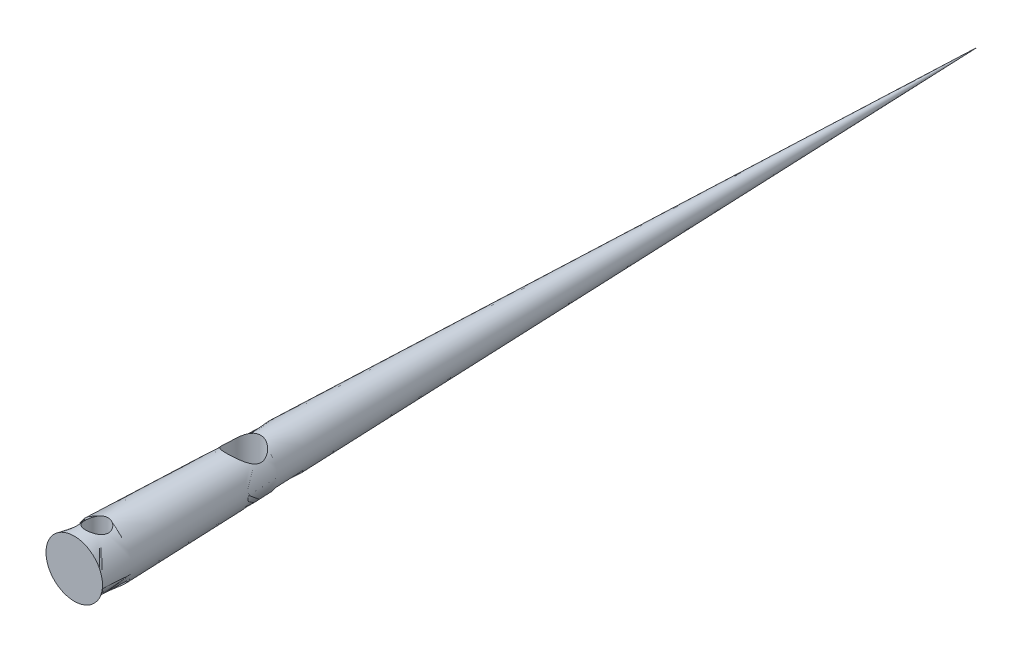
ISO-10303-21;
HEADER;
FILE_DESCRIPTION(('STEP AP214'),'2;1');
FILE_NAME('part.step','',(''),(''),'','','');
FILE_SCHEMA(('AUTOMOTIVE_DESIGN { 1 0 10303 214 1 1 1 1 }'));
ENDSEC;
DATA;
#1=APPLICATION_CONTEXT('core data for automotive mechanical design processes');
#2=APPLICATION_PROTOCOL_DEFINITION('international standard','automotive_design',2000,#1);
#3=PRODUCT_CONTEXT('',#1,'mechanical');
#4=PRODUCT('Part','Part','',(#3));
#5=PRODUCT_RELATED_PRODUCT_CATEGORY('part','',(#4));
#6=PRODUCT_DEFINITION_FORMATION('','',#4);
#7=PRODUCT_DEFINITION_CONTEXT('part definition',#1,'design');
#8=PRODUCT_DEFINITION('design','',#6,#7);
#9=PRODUCT_DEFINITION_SHAPE('','',#8);
#10=(LENGTH_UNIT() NAMED_UNIT(*) SI_UNIT(.MILLI.,.METRE.));
#11=(NAMED_UNIT(*) PLANE_ANGLE_UNIT() SI_UNIT($,.RADIAN.));
#12=(NAMED_UNIT(*) SI_UNIT($,.STERADIAN.) SOLID_ANGLE_UNIT());
#13=UNCERTAINTY_MEASURE_WITH_UNIT(LENGTH_MEASURE(1.E-05),#10,'distance_accuracy_value','');
#14=(GEOMETRIC_REPRESENTATION_CONTEXT(3) GLOBAL_UNCERTAINTY_ASSIGNED_CONTEXT((#13)) GLOBAL_UNIT_ASSIGNED_CONTEXT((#10,
#11,#12)) REPRESENTATION_CONTEXT('',''));
#15=CARTESIAN_POINT('',(0.,0.,0.));
#16=DIRECTION('',(0.,0.,1.));
#17=DIRECTION('',(1.,0.,0.));
#18=AXIS2_PLACEMENT_3D('',#15,#16,#17);
#19=CARTESIAN_POINT('',(0.,0.,0.));
#20=DIRECTION('',(0.,0.,-1.));
#21=DIRECTION('',(-1.,0.,0.));
#22=AXIS2_PLACEMENT_3D('',#19,#20,#21);
#23=PLANE('',#22);
#24=CARTESIAN_POINT('',(0.,0.,0.));
#25=DIRECTION('',(0.,0.,-1.));
#26=DIRECTION('',(-1.,0.,0.));
#27=AXIS2_PLACEMENT_3D('',#24,#25,#26);
#28=CIRCLE('',#27,2.5);
#29=CARTESIAN_POINT('',(-2.5,0.,0.));
#30=VERTEX_POINT('',#29);
#31=EDGE_CURVE('E11',#30,#30,#28,.T.);
#32=ORIENTED_EDGE('',*,*,#31,.F.);
#33=EDGE_LOOP('',(#32));
#34=FACE_BOUND('',#33,.T.);
#35=ADVANCED_FACE('F34',(#34),#23,.F.);
#36=CARTESIAN_POINT('',(0.,0.,0.));
#37=DIRECTION('',(0.,0.,1.));
#38=DIRECTION('',(1.,0.,0.));
#39=AXIS2_PLACEMENT_3D('',#36,#37,#38);
#40=CONICAL_SURFACE('',#39,2.5,0.0312398334302683);
#41=CARTESIAN_POINT('',(-0.718303702030486,-2.30649705568448,-2.69572968288667));
#42=CARTESIAN_POINT('',(-0.75648457829971,-2.29589573432455,-2.65630561576566));
#43=CARTESIAN_POINT('',(-0.791473075939275,-2.28537138140363,-2.61367773882));
#44=CARTESIAN_POINT('',(-0.854154164816171,-2.26572551321165,-2.52294489669194));
#45=CARTESIAN_POINT('',(-0.881830296304176,-2.2566071816953,-2.47482791831813));
#46=CARTESIAN_POINT('',(-0.929023458303325,-2.24099846398884,-2.37417660330026));
#47=CARTESIAN_POINT('',(-0.948521251009205,-2.23451427517481,-2.32163219655927));
#48=CARTESIAN_POINT('',(-0.978486512656946,-2.22524129599332,-2.21375653009383));
#49=CARTESIAN_POINT('',(-0.988964167533105,-2.22244833541621,-2.15842848873001));
#50=CARTESIAN_POINT('',(-1.00016069479146,-2.22115168871428,-2.04987900237051));
#51=CARTESIAN_POINT('',(-1.00139269971042,-2.22241679415205,-1.99671285806836));
#52=CARTESIAN_POINT('',(-0.995456966864628,-2.22869746307888,-1.89107569344925));
#53=CARTESIAN_POINT('',(-0.988288229391214,-2.23371347290892,-1.83860475661518));
#54=CARTESIAN_POINT('',(-0.966188139750031,-2.24681101123519,-1.73710332098273));
#55=CARTESIAN_POINT('',(-0.951449556828669,-2.25481512463017,-1.68802021357848));
#56=CARTESIAN_POINT('',(-0.914863359344654,-2.27310472699428,-1.59303882912516));
#57=CARTESIAN_POINT('',(-0.893013706103514,-2.28339086993077,-1.54714146998451));
#58=CARTESIAN_POINT('',(-0.840983086998132,-2.30610954057545,-1.45622992878971));
#59=CARTESIAN_POINT('',(-0.810312729364113,-2.3186436423857,-1.41152134472736));
#60=CARTESIAN_POINT('',(-0.742225342653889,-2.34407594793812,-1.3276751270533));
#61=CARTESIAN_POINT('',(-0.70480523593778,-2.3569743155,-1.28854004938529));
#62=CARTESIAN_POINT('',(-0.621333974772019,-2.38278617411419,-1.21434036013368));
#63=CARTESIAN_POINT('',(-0.57487838227508,-2.39564547721984,-1.17970939151217));
#64=CARTESIAN_POINT('',(-0.47626522643162,-2.41912083911096,-1.11879211740924));
#65=CARTESIAN_POINT('',(-0.424108996691459,-2.42973742086124,-1.09250386582706));
#66=CARTESIAN_POINT('',(-0.317247423615037,-2.44728551641102,-1.04997243431996));
#67=CARTESIAN_POINT('',(-0.26267855638568,-2.45432484262882,-1.03343261196579));
#68=CARTESIAN_POINT('',(-0.151179456682107,-2.46444240178472,-1.00985546474255));
#69=CARTESIAN_POINT('',(-0.0942506829476691,-2.46752304511757,-1.00281235730821));
#70=CARTESIAN_POINT('',(0.0156191269561355,-2.46930450388147,-0.998729217655562));
#71=CARTESIAN_POINT('',(0.0685292574424662,-2.46832465253404,-1.00095990429496));
#72=CARTESIAN_POINT('',(0.17314662779563,-2.4627986099123,-1.0136956000108));
#73=CARTESIAN_POINT('',(0.224853937547789,-2.45825262637011,-1.02420012712476));
#74=CARTESIAN_POINT('',(0.32484881997843,-2.44613006211132,-1.05282627284154));
#75=CARTESIAN_POINT('',(0.373176752898305,-2.43860115995748,-1.0708282741948));
#76=CARTESIAN_POINT('',(0.466154184405307,-2.42118110503871,-1.11381402589515));
#77=CARTESIAN_POINT('',(0.510802785854646,-2.41128937842097,-1.13879947254389));
#78=CARTESIAN_POINT('',(0.598192012233841,-2.38929207845383,-1.19682654185738));
#79=CARTESIAN_POINT('',(0.640636634320063,-2.3770864746431,-1.2302756159123));
#80=CARTESIAN_POINT('',(0.719520151159049,-2.35202072733574,-1.30344558336307));
#81=CARTESIAN_POINT('',(0.755955937339899,-2.33916024952519,-1.34316970237487));
#82=CARTESIAN_POINT('',(0.824264267742589,-2.31310044877894,-1.4308952198043));
#83=CARTESIAN_POINT('',(0.855670257553521,-2.2999357524889,-1.47927201212775));
#84=CARTESIAN_POINT('',(0.909864184909221,-2.27561516327655,-1.58110671670212));
#85=CARTESIAN_POINT('',(0.932653658324634,-2.26445891254017,-1.63456372129127));
#86=CARTESIAN_POINT('',(0.96833034464823,-2.24571017371739,-1.74393678351161));
#87=CARTESIAN_POINT('',(0.981428546158398,-2.238043243709,-1.79977060053116));
#88=CARTESIAN_POINT('',(0.997874902202293,-2.22687586888866,-1.91324879390349));
#89=CARTESIAN_POINT('',(1.00123061471216,-2.22337219557485,-1.97089173167415));
#90=CARTESIAN_POINT('',(0.998101278556672,-2.22100408793086,-2.08102961075716));
#91=CARTESIAN_POINT('',(0.992436209914106,-2.22176724876632,-2.13354172624449));
#92=CARTESIAN_POINT('',(0.972966417497071,-2.226838908155,-2.23685334953533));
#93=CARTESIAN_POINT('',(0.959161149463116,-2.23114764377547,-2.28765274258489));
#94=CARTESIAN_POINT('',(0.924138880898341,-2.24256858503117,-2.38553473418221));
#95=CARTESIAN_POINT('',(0.903018043649304,-2.24964456383151,-2.4326562824173));
#96=CARTESIAN_POINT('',(0.853968131612332,-2.26570527773923,-2.52285383325377));
#97=CARTESIAN_POINT('',(0.826036908862409,-2.27469061493372,-2.56592855355626));
#98=CARTESIAN_POINT('',(0.761759172741606,-2.29427484548304,-2.65017904421915));
#99=CARTESIAN_POINT('',(0.724944658691861,-2.30494381914008,-2.6909818372593));
#100=CARTESIAN_POINT('',(0.645108807153037,-2.32611557184205,-2.76605402419059));
#101=CARTESIAN_POINT('',(0.602085443876409,-2.33661829539792,-2.80032127719873));
#102=CARTESIAN_POINT('',(0.508808024059521,-2.35672997118652,-2.86278459481898));
#103=CARTESIAN_POINT('',(0.458322157420544,-2.36628084701679,-2.89065511082412));
#104=CARTESIAN_POINT('',(0.352954999482224,-2.38279576694241,-2.93741200418514));
#105=CARTESIAN_POINT('',(0.298075292316391,-2.38976073828695,-2.95630160258609));
#106=CARTESIAN_POINT('',(0.18799356221242,-2.40001363969618,-2.98373534849563));
#107=CARTESIAN_POINT('',(0.132908162234909,-2.40344758968422,-2.99269164877165));
#108=CARTESIAN_POINT('',(0.0219222675870296,-2.40674878388156,-3.00130622993913));
#109=CARTESIAN_POINT('',(-0.0339778562649829,-2.40661760301609,-3.00096861649086));
#110=CARTESIAN_POINT('',(-0.141912197366016,-2.40291013972468,-2.99128408859448));
#111=CARTESIAN_POINT('',(-0.193995931950924,-2.3995139859775,-2.98240821467804));
#112=CARTESIAN_POINT('',(-0.29590219796317,-2.38989993749601,-2.95666368271322));
#113=CARTESIAN_POINT('',(-0.345723308270828,-2.38368029561419,-2.9397900754583));
#114=CARTESIAN_POINT('',(-0.442694614232629,-2.36892886990363,-2.89825186252119));
#115=CARTESIAN_POINT('',(-0.489780836990082,-2.36035759765457,-2.87345288140295));
#116=CARTESIAN_POINT('',(-0.579173771894317,-2.34184594280009,-2.81691277887558));
#117=CARTESIAN_POINT('',(-0.621489445367106,-2.33190820775534,-2.78518501390419));
#118=CARTESIAN_POINT('',(-0.68081270335848,-2.31671933529144,-2.73293576790774));
#119=CARTESIAN_POINT('',(-0.69992793186541,-2.31159928129561,-2.71470377848573));
#120=CARTESIAN_POINT('',(-0.718303702030486,-2.30649705568448,-2.69572968288667));
#121=B_SPLINE_CURVE_WITH_KNOTS('',3,(#41,#42,#43,#44,#45,#46,#47,#48,#49,#50,#51,#52,#53,#54,
#55,#56,#57,#58,#59,#60,#61,#62,#63,#64,#65,#66,#67,#68,#69,#70,#71,#72,#73,#74,#75,#76,#77,#78,
#79,#80,#81,#82,#83,#84,#85,#86,#87,#88,#89,#90,#91,#92,#93,#94,#95,#96,#97,#98,#99,#100,#101,
#102,#103,#104,#105,#106,#107,#108,#109,#110,#111,#112,#113,#114,#115,#116,#117,#118,#119,#120),
.UNSPECIFIED.,.T.,.F.,(4,2,2,2,2,2,2,2,2,2,2,2,2,2,2,2,2,2,2,2,2,2,2,2,2,2,2,2,2,2,2,2,2,2,2,2,
2,2,2,4),(0.,0.167614777946653,0.335603694113374,0.503985582041032,0.672177075418805,
0.830959666391205,0.989761154794746,1.14470563402471,1.29969457360053,1.46592678185801,
1.63223497843719,1.80942059055048,1.98656484024635,2.15799554518037,2.32932181846751,
2.4874405429608,2.64555005750419,2.80122821419692,2.95694421853458,3.12244115558405,
3.2880234429694,3.46465160397526,3.64124826663195,3.81387697664462,3.9863717298458,
4.14405998642327,4.30175878734474,4.4574587218631,4.61320782703828,4.78041780859781,
4.94768247033168,5.12216041223071,5.29657572956498,5.46344665961665,5.63024387429173,
5.78833731583319,5.94652871771568,6.1075588568045,6.26828128002726,6.34895126292916),.UNSPECIFIED.);
#122=CARTESIAN_POINT('',(-0.718303702030486,-2.30649705568448,-2.69572968288667));
#123=VERTEX_POINT('',#122);
#124=EDGE_CURVE('E37',#123,#123,#121,.T.);
#125=ORIENTED_EDGE('',*,*,#124,.T.);
#126=EDGE_LOOP('',(#125));
#127=FACE_BOUND('',#126,.T.);
#128=CARTESIAN_POINT('',(-0.718303702030486,2.30649705568448,-2.69572968288667));
#129=CARTESIAN_POINT('',(-0.679580822232323,2.31724679165609,-2.73570461148873));
#130=CARTESIAN_POINT('',(-0.637478971563808,2.32810048062209,-2.77248240253598));
#131=CARTESIAN_POINT('',(-0.547488670870926,2.34876919527608,-2.8386823079649));
#132=CARTESIAN_POINT('',(-0.499586643551268,2.35858167894093,-2.86808664863408));
#133=CARTESIAN_POINT('',(-0.399116218591903,2.37604475004225,-2.91862350161256));
#134=CARTESIAN_POINT('',(-0.346540958166484,2.38369208660134,-2.93974359360244));
#135=CARTESIAN_POINT('',(-0.238283461510591,2.39589335479316,-2.97284115085449));
#136=CARTESIAN_POINT('',(-0.182604319037608,2.40045030911059,-2.98482755114983));
#137=CARTESIAN_POINT('',(-0.0723606594771982,2.40580222075643,-2.99885570151753));
#138=CARTESIAN_POINT('',(-0.0178572037906255,2.40675591516318,-3.00131718382809));
#139=CARTESIAN_POINT('',(0.090777372438345,2.40523316147071,-2.99735303635323));
#140=CARTESIAN_POINT('',(0.144908502142406,2.40275679807906,-2.99092762603559));
#141=CARTESIAN_POINT('',(0.24947986310665,2.39478736375936,-2.96980199837023));
#142=CARTESIAN_POINT('',(0.299982726664768,2.38939274486102,-2.95537146274444));
#143=CARTESIAN_POINT('',(0.397840539037749,2.37621521060518,-2.9189397948413));
#144=CARTESIAN_POINT('',(0.445194996229456,2.36843192331813,-2.8969374835297));
#145=CARTESIAN_POINT('',(0.537512009573556,2.35090456317712,-2.84498425325864));
#146=CARTESIAN_POINT('',(0.582301865488666,2.34109424072992,-2.81474933782944));
#147=CARTESIAN_POINT('',(0.666360424469717,2.32075430624744,-2.74757024776615));
#148=CARTESIAN_POINT('',(0.705626699374331,2.31022438087873,-2.71062313871005));
#149=CARTESIAN_POINT('',(0.77984478759271,2.28898493672574,-2.62854966850956));
#150=CARTESIAN_POINT('',(0.814421286685914,2.2782996037203,-2.5830763149192));
#151=CARTESIAN_POINT('',(0.875477395024823,2.25877686444759,-2.48661637273714));
#152=CARTESIAN_POINT('',(0.901958110000808,2.24993920587527,-2.43563053833437));
#153=CARTESIAN_POINT('',(0.945537361756004,2.23554480243434,-2.33037305319826));
#154=CARTESIAN_POINT('',(0.962787843646829,2.22993480062248,-2.27617205603264));
#155=CARTESIAN_POINT('',(0.98785957893856,2.22273321111792,-2.16538727135977));
#156=CARTESIAN_POINT('',(0.99568751014558,2.2211387766973,-2.10880520079865));
#157=CARTESIAN_POINT('',(1.0013772320009,2.22232160820147,-1.99959836620515));
#158=CARTESIAN_POINT('',(0.999963439477718,2.22477008805359,-1.94700623940176));
#159=CARTESIAN_POINT('',(0.988979375360009,2.2332298701228,-1.84297833413726));
#160=CARTESIAN_POINT('',(0.979408438131169,2.23924146308266,-1.79154265039507));
#161=CARTESIAN_POINT('',(0.952658790117954,2.25413974933707,-1.69162431940749));
#162=CARTESIAN_POINT('',(0.935544939725832,2.26300176042976,-1.64312042079933));
#163=CARTESIAN_POINT('',(0.894307399288866,2.2827499350063,-1.54963710086932));
#164=CARTESIAN_POINT('',(0.87018136995443,2.29363677354314,-1.50465886208922));
#165=CARTESIAN_POINT('',(0.813339000586153,2.31738289026395,-1.41563019048071));
#166=CARTESIAN_POINT('',(0.780088599238639,2.33033034776617,-1.37194398384956));
#167=CARTESIAN_POINT('',(0.706895645625254,2.3562212739874,-1.29056663042477));
#168=CARTESIAN_POINT('',(0.666950271047298,2.36916473870812,-1.25287802507872));
#169=CARTESIAN_POINT('',(0.578900566869788,2.39450820402672,-1.18255685331475));
#170=CARTESIAN_POINT('',(0.530475009307128,2.40684254779095,-1.15030046187787));
#171=CARTESIAN_POINT('',(0.428294626976009,2.42887712707218,-1.0944899246291));
#172=CARTESIAN_POINT('',(0.374541833163326,2.43857836120261,-1.07093247849502));
#173=CARTESIAN_POINT('',(0.265812078819431,2.4539037539089,-1.03435005653916));
#174=CARTESIAN_POINT('',(0.211006108461996,2.45969541325739,-1.02088916556853));
#175=CARTESIAN_POINT('',(0.0996486139502029,2.46726203574617,-1.00338472793655));
#176=CARTESIAN_POINT('',(0.0430980478952947,2.46903916514465,-0.999336102340634));
#177=CARTESIAN_POINT('',(-0.0656896443030092,2.46840694851293,-1.00078732284981));
#178=CARTESIAN_POINT('',(-0.117939092895651,2.46629493537277,-1.00560899014602));
#179=CARTESIAN_POINT('',(-0.220797421517367,2.45866679347436,-1.02328533692814));
#180=CARTESIAN_POINT('',(-0.271406292539263,2.45315064602991,-1.03614006050968));
#181=CARTESIAN_POINT('',(-0.369577714278642,2.43924148167794,-1.06935749726233));
#182=CARTESIAN_POINT('',(-0.417144443513427,2.4308525160082,-1.08970964064355));
#183=CARTESIAN_POINT('',(-0.508253616564919,2.41193115993023,-1.13725949904338));
#184=CARTESIAN_POINT('',(-0.551794904264742,2.40139815651279,-1.16445917239063));
#185=CARTESIAN_POINT('',(-0.636879477617356,2.3782758746029,-1.22710497751365));
#186=CARTESIAN_POINT('',(-0.678071664703459,2.36559442141962,-1.26299392026379));
#187=CARTESIAN_POINT('',(-0.754055547522054,2.33992415612625,-1.34093600616893));
#188=CARTESIAN_POINT('',(-0.788843957479409,2.32693519006755,-1.38299229401323));
#189=CARTESIAN_POINT('',(-0.853048251931854,2.30113681506917,-1.47499203984722));
#190=CARTESIAN_POINT('',(-0.882035799249576,2.28838146200547,-1.52525138115696));
#191=CARTESIAN_POINT('',(-0.931038391692253,2.26533308328275,-1.63049629837636));
#192=CARTESIAN_POINT('',(-0.9510567427506,2.25503915102832,-1.68548012397984));
#193=CARTESIAN_POINT('',(-0.980683031658509,2.23852461116237,-1.79645934616684));
#194=CARTESIAN_POINT('',(-0.990664260943067,2.23216163890046,-1.85233301442875));
#195=CARTESIAN_POINT('',(-1.00100049177506,2.22367784077955,-1.96526215959091));
#196=CARTESIAN_POINT('',(-1.0013629358168,2.2215537362916,-2.02231668859251));
#197=CARTESIAN_POINT('',(-0.992763898417681,2.221690502186,-2.13091458181651));
#198=CARTESIAN_POINT('',(-0.984574917862441,2.22360156862443,-2.18252184792787));
#199=CARTESIAN_POINT('',(-0.960338389099179,2.23073497104802,-2.28364574967685));
#200=CARTESIAN_POINT('',(-0.944285549391269,2.23595953734739,-2.333160953186));
#201=CARTESIAN_POINT('',(-0.904765417654705,2.24901066719527,-2.42907959462205));
#202=CARTESIAN_POINT('',(-0.881255944641271,2.25685204713636,-2.4754634627574));
#203=CARTESIAN_POINT('',(-0.827556156311664,2.27415292140997,-2.56374836585452));
#204=CARTESIAN_POINT('',(-0.797378691701951,2.28360929543454,-2.60565779669714));
#205=CARTESIAN_POINT('',(-0.749511973945608,2.29769300316587,-2.66238679979421));
#206=CARTESIAN_POINT('',(-0.734192276925045,2.3020862787492,-2.67932737370127));
#207=CARTESIAN_POINT('',(-0.718303702030486,2.30649705568448,-2.69572968288667));
#208=B_SPLINE_CURVE_WITH_KNOTS('',3,(#128,#129,#130,#131,#132,#133,#134,#135,#136,#137,#138,
#139,#140,#141,#142,#143,#144,#145,#146,#147,#148,#149,#150,#151,#152,#153,#154,#155,#156,#157,
#158,#159,#160,#161,#162,#163,#164,#165,#166,#167,#168,#169,#170,#171,#172,#173,#174,#175,#176,
#177,#178,#179,#180,#181,#182,#183,#184,#185,#186,#187,#188,#189,#190,#191,#192,#193,#194,#195,
#196,#197,#198,#199,#200,#201,#202,#203,#204,#205,#206,#207),.UNSPECIFIED.,.T.,.F.,(4,2,2,2,2,2,
2,2,2,2,2,2,2,2,2,2,2,2,2,2,2,2,2,2,2,2,2,2,2,2,2,2,2,2,2,2,2,2,2,4),(0.,0.169986226944868,
0.340378350069814,0.511024969242734,0.681504438302045,0.844379683528025,1.00725090651227,
1.16494197631972,1.32265761201087,1.48671390264479,1.65084208839932,1.82435941366291,
1.9978530291585,2.16839518700421,2.3388164095229,2.496048337465,2.65329309697881,
2.80921133791421,2.96518165358821,3.13367063738445,3.30223082835,3.47976819704992,
3.65723813987605,3.82651753010424,3.99570555458036,4.15249155550985,4.3092784170878,
4.46584508271993,4.62245657590164,4.78998991310888,4.95760897343422,5.13494463798609,
5.31221488495327,5.4826169758114,5.65288721492689,5.80900458622327,5.96522715168928,
6.12234969600618,6.27917203107469,6.3489199142883),.UNSPECIFIED.);
#209=CARTESIAN_POINT('',(-0.718303702030486,2.30649705568448,-2.69572968288667));
#210=VERTEX_POINT('',#209);
#211=EDGE_CURVE('E92',#210,#210,#208,.T.);
#212=ORIENTED_EDGE('',*,*,#211,.T.);
#213=EDGE_LOOP('',(#212));
#214=FACE_BOUND('',#213,.T.);
#215=CARTESIAN_POINT('',(-0.816822761145585,-1.81675641597548,-16.2580940254506));
#216=CARTESIAN_POINT('',(-0.892851821336597,-1.78425960499798,-16.2087295217959));
#217=CARTESIAN_POINT('',(-0.963606245087627,-1.74868605941709,-16.1529895795781));
#218=CARTESIAN_POINT('',(-1.09373545596457,-1.6749847807063,-16.0304356191029));
#219=CARTESIAN_POINT('',(-1.15305020330919,-1.63684491692372,-15.9635664310989));
#220=CARTESIAN_POINT('',(-1.25949764017875,-1.56219744194831,-15.8195805082776));
#221=CARTESIAN_POINT('',(-1.30659890994107,-1.52569423658837,-15.7424381009806));
#222=CARTESIAN_POINT('',(-1.38691503890912,-1.46013702058996,-15.5785400484477));
#223=CARTESIAN_POINT('',(-1.42019895185736,-1.43104625456076,-15.4918350170308));
#224=CARTESIAN_POINT('',(-1.46090655005722,-1.39587048813302,-15.3451439139623));
#225=CARTESIAN_POINT('',(-1.47335241112538,-1.3852413892027,-15.2876534741839));
#226=CARTESIAN_POINT('',(-1.4914142634511,-1.37118231528134,-15.1707771152166));
#227=CARTESIAN_POINT('',(-1.49704117570945,-1.36774082244711,-15.1113943836488));
#228=CARTESIAN_POINT('',(-1.50116498433123,-1.36874213582558,-14.9923352447576));
#229=CARTESIAN_POINT('',(-1.49964836950363,-1.3731998726204,-14.9326584943596));
#230=CARTESIAN_POINT('',(-1.48970834281314,-1.38937525682519,-14.8148608543977));
#231=CARTESIAN_POINT('',(-1.48127473887346,-1.40110361114747,-14.7567423915327));
#232=CARTESIAN_POINT('',(-1.45450624470477,-1.43479643212205,-14.6255859778505));
#233=CARTESIAN_POINT('',(-1.43390305894502,-1.45881291545945,-14.5535508833253));
#234=CARTESIAN_POINT('',(-1.38327968601376,-1.51276370424121,-14.4151967174583));
#235=CARTESIAN_POINT('',(-1.35323434123012,-1.54271373926903,-14.348893527053));
#236=CARTESIAN_POINT('',(-1.27479470470165,-1.61434162713711,-14.2040776940544));
#237=CARTESIAN_POINT('',(-1.22360913102589,-1.65691871010562,-14.1275208425759));
#238=CARTESIAN_POINT('',(-1.10808731311646,-1.74159003232471,-13.9848373208709));
#239=CARTESIAN_POINT('',(-1.04375738312823,-1.78368449320002,-13.9187056695397));
#240=CARTESIAN_POINT('',(-0.913805922173088,-1.85695929391772,-13.8079331496562));
#241=CARTESIAN_POINT('',(-0.85005331947158,-1.8888064554601,-13.7615465276171));
#242=CARTESIAN_POINT('',(-0.71422222151515,-1.94698813351946,-13.6785624417421));
#243=CARTESIAN_POINT('',(-0.642156521190676,-1.97333095076951,-13.6419502143003));
#244=CARTESIAN_POINT('',(-0.502874289094586,-2.0147178721248,-13.5851326552919));
#245=CARTESIAN_POINT('',(-0.436679297750391,-2.03088765371176,-13.563252104702));
#246=CARTESIAN_POINT('',(-0.30065411105068,-2.05651467393378,-13.5287693096643));
#247=CARTESIAN_POINT('',(-0.230825896551093,-2.06597552999581,-13.5161620649486));
#248=CARTESIAN_POINT('',(-0.0892278969968427,-2.07739658015762,-13.5009591894674));
#249=CARTESIAN_POINT('',(-0.0174524418579125,-2.07933179978527,-13.4983968935012));
#250=CARTESIAN_POINT('',(0.125515543717816,-2.07545227325491,-13.503550010559));
#251=CARTESIAN_POINT('',(0.196708048841688,-2.06963719233911,-13.5112658675259));
#252=CARTESIAN_POINT('',(0.332615653046747,-2.05128745093737,-13.535798353739));
#253=CARTESIAN_POINT('',(0.397474258065942,-2.03912399126355,-13.5521126873116));
#254=CARTESIAN_POINT('',(0.523276929690415,-2.00921394049524,-13.5926785195826));
#255=CARTESIAN_POINT('',(0.584220075771177,-1.99146604224101,-13.6169318766363));
#256=CARTESIAN_POINT('',(0.70658834559361,-1.94966572319946,-13.674960083577));
#257=CARTESIAN_POINT('',(0.767547416898258,-1.92518505074735,-13.7094030577961));
#258=CARTESIAN_POINT('',(0.882988823509843,-1.87242418553331,-13.7854562021652));
#259=CARTESIAN_POINT('',(0.937467142689297,-1.84414165964227,-13.827070777856));
#260=CARTESIAN_POINT('',(1.04939374308567,-1.77967918303732,-13.9251404807514));
#261=CARTESIAN_POINT('',(1.10541453176627,-1.74302379671542,-13.9829115714363));
#262=CARTESIAN_POINT('',(1.20748992167226,-1.66916945569842,-14.1064673239812));
#263=CARTESIAN_POINT('',(1.25353445601768,-1.6319699920067,-14.1722599766472));
#264=CARTESIAN_POINT('',(1.33141218694758,-1.56346818830952,-14.3052083818173));
#265=CARTESIAN_POINT('',(1.36414887869761,-1.53193608507862,-14.3717142209326));
#266=CARTESIAN_POINT('',(1.41997271517142,-1.47431024837985,-14.5108480687611));
#267=CARTESIAN_POINT('',(1.443079707017,-1.44820538543908,-14.583463110983));
#268=CARTESIAN_POINT('',(1.47391757189143,-1.41073842199137,-14.7154715441188));
#269=CARTESIAN_POINT('',(1.48403459095065,-1.39732843694545,-14.7737120138862));
#270=CARTESIAN_POINT('',(1.49729735247855,-1.37765251402252,-14.8921325072023));
#271=CARTESIAN_POINT('',(1.50045489975876,-1.37137448753947,-14.9523090704699));
#272=CARTESIAN_POINT('',(1.49943738749426,-1.36689107867574,-15.0731131033245));
#273=CARTESIAN_POINT('',(1.49523826535168,-1.3687122174779,-15.1337414043096));
#274=CARTESIAN_POINT('',(1.47968205913037,-1.38003543249608,-15.2533620611269));
#275=CARTESIAN_POINT('',(1.46831530522364,-1.38954788994514,-15.3123520943537));
#276=CARTESIAN_POINT('',(1.43530776446359,-1.41792325994906,-15.4421067996031));
#277=CARTESIAN_POINT('',(1.41177430820733,-1.43856397774844,-15.5119886929769));
#278=CARTESIAN_POINT('',(1.35575720067975,-1.48581336125513,-15.6459273076409));
#279=CARTESIAN_POINT('',(1.32325162386106,-1.51243661672726,-15.7099692408561));
#280=CARTESIAN_POINT('',(1.23981272122042,-1.57645596862787,-15.8492322568871));
#281=CARTESIAN_POINT('',(1.18626767722532,-1.61476541523954,-15.9224697451337));
#282=CARTESIAN_POINT('',(1.06682900236018,-1.6910410774557,-16.0583268998743));
#283=CARTESIAN_POINT('',(1.00092827880453,-1.7290070827226,-16.1209404282388));
#284=CARTESIAN_POINT('',(0.857142809221056,-1.80070439570858,-16.234387973806));
#285=CARTESIAN_POINT('',(0.77921951654554,-1.8344214253329,-16.2851827354197));
#286=CARTESIAN_POINT('',(0.612896866631935,-1.89359054078703,-16.3722619550227));
#287=CARTESIAN_POINT('',(0.524527457559477,-1.91906550727532,-16.4085866491927));
#288=CARTESIAN_POINT('',(0.36665020992521,-1.95276486601607,-16.4561218215337));
#289=CARTESIAN_POINT('',(0.299004450024184,-1.96384153231879,-16.471547575241));
#290=CARTESIAN_POINT('',(0.161483598798463,-1.97922164080738,-16.4929002274758));
#291=CARTESIAN_POINT('',(0.0916101851361174,-1.98353006275617,-16.4988341097445));
#292=CARTESIAN_POINT('',(-0.0484256097748391,-1.98499469679031,-16.5008550579256));
#293=CARTESIAN_POINT('',(-0.118588218152451,-1.98214335652259,-16.4969317261214));
#294=CARTESIAN_POINT('',(-0.257097669195533,-1.96952656494338,-16.4794520056584));
#295=CARTESIAN_POINT('',(-0.325443162221396,-1.95975611562552,-16.4658886535221));
#296=CARTESIAN_POINT('',(-0.458020624033667,-1.93421302548971,-16.4300023379388));
#297=CARTESIAN_POINT('',(-0.522278561998143,-1.91848390067281,-16.4077428461107));
#298=CARTESIAN_POINT('',(-0.645963194271752,-1.88217168335469,-16.3554457483959));
#299=CARTESIAN_POINT('',(-0.705396385278943,-1.86159526873324,-16.3254188377783));
#300=CARTESIAN_POINT('',(-0.780598029903453,-1.83194214811605,-16.2810670026911));
#301=CARTESIAN_POINT('',(-0.798857648200122,-1.8244351756249,-16.269758497975));
#302=CARTESIAN_POINT('',(-0.816822761145585,-1.81675641597548,-16.2580940254506));
#303=B_SPLINE_CURVE_WITH_KNOTS('',3,(#215,#216,#217,#218,#219,#220,#221,#222,#223,#224,#225,
#226,#227,#228,#229,#230,#231,#232,#233,#234,#235,#236,#237,#238,#239,#240,#241,#242,#243,#244,
#245,#246,#247,#248,#249,#250,#251,#252,#253,#254,#255,#256,#257,#258,#259,#260,#261,#262,#263,
#264,#265,#266,#267,#268,#269,#270,#271,#272,#273,#274,#275,#276,#277,#278,#279,#280,#281,#282,
#283,#284,#285,#286,#287,#288,#289,#290,#291,#292,#293,#294,#295,#296,#297,#298,#299,#300,#301,
#302),.UNSPECIFIED.,.T.,.F.,(4,2,2,2,2,2,2,2,2,2,2,2,2,2,2,2,2,2,2,2,2,2,2,2,2,2,2,2,2,2,2,2,2,
2,2,2,2,2,2,2,2,2,2,4),(0.,0.288840514917826,0.579158014163766,0.870215121239359,
1.15979959944233,1.33839798879241,1.51670996128595,1.69535932642461,1.87427240257404,
2.10900847793744,2.34437536187216,2.64727957695145,2.95003862449155,3.20414318563495,
3.45786173810736,3.67165368078634,3.8853302598351,4.09971534089126,4.31410968215601,
4.51717828714032,4.72029446016824,4.94199428086053,5.16383078121429,5.42812910353747,
5.69269289565612,5.93356010657398,6.17392839747207,6.35504798241021,6.5358601110628,
6.71726475460048,6.89891465566899,7.12737199982792,7.35639265455283,7.65039247789533,
7.94456158925359,8.2396942521569,8.53400042822167,8.74387353665144,8.95359215765793,
9.16353208968503,9.37362382634719,9.5822099577537,9.79051039337211,9.85876130244145),.UNSPECIFIED.);
#304=CARTESIAN_POINT('',(-0.816822761145585,-1.81675641597548,-16.2580940254506));
#305=VERTEX_POINT('',#304);
#306=EDGE_CURVE('E45',#305,#305,#303,.T.);
#307=ORIENTED_EDGE('',*,*,#306,.T.);
#308=EDGE_LOOP('',(#307));
#309=FACE_BOUND('',#308,.T.);
#310=CARTESIAN_POINT('',(-0.816822761145585,1.81675641597548,-16.2580940254506));
#311=CARTESIAN_POINT('',(-0.756726580235831,1.84243717890411,-16.2971100760854));
#312=CARTESIAN_POINT('',(-0.693197605889302,1.86625933013952,-16.3322303334441));
#313=CARTESIAN_POINT('',(-0.560121087211784,1.90843176609703,-16.3934241300723));
#314=CARTESIAN_POINT('',(-0.490567433433958,1.92677641041685,-16.4194883484728));
#315=CARTESIAN_POINT('',(-0.346495775181412,1.95650432059528,-16.4613666069163));
#316=CARTESIAN_POINT('',(-0.271951130892388,1.96784627147723,-16.4771198456899));
#317=CARTESIAN_POINT('',(-0.12058151575518,1.98225407868857,-16.497088980296));
#318=CARTESIAN_POINT('',(-0.0437587471973706,1.98532768036274,-16.5013156736271));
#319=CARTESIAN_POINT('',(0.10287293264458,1.98300526900856,-16.4981088562097));
#320=CARTESIAN_POINT('',(0.172717361246601,1.97831426067704,-16.4916459677217));
#321=CARTESIAN_POINT('',(0.310065244835536,1.96219306378553,-16.4692527060794));
#322=CARTESIAN_POINT('',(0.377568079142456,1.95076110265584,-16.4533198427356));
#323=CARTESIAN_POINT('',(0.508737867939339,1.92205083273484,-16.4127684006134));
#324=CARTESIAN_POINT('',(0.57239541471708,1.90475881941588,-16.3881294556649));
#325=CARTESIAN_POINT('',(0.694614029856974,1.86556782582453,-16.3311879345585));
#326=CARTESIAN_POINT('',(0.753174479912675,1.84366828773153,-16.2988844304125));
#327=CARTESIAN_POINT('',(0.872653098994248,1.79318610455096,-16.2223805839907));
#328=CARTESIAN_POINT('',(0.932684295376638,1.76409490169035,-16.1771347960305));
#329=CARTESIAN_POINT('',(1.04483833718141,1.70368184383631,-16.0788360084692));
#330=CARTESIAN_POINT('',(1.09694637181291,1.67235596825954,-16.0257687439806));
#331=CARTESIAN_POINT('',(1.20173924834797,1.60395590465768,-15.9019862112759));
#332=CARTESIAN_POINT('',(1.25273341692819,1.56689478381774,-15.829823801644));
#333=CARTESIAN_POINT('',(1.34201057769693,1.49759587158482,-15.6759330557768));
#334=CARTESIAN_POINT('',(1.38031928835681,1.46534839487486,-15.5942245342551));
#335=CARTESIAN_POINT('',(1.43148572924694,1.42138876244468,-15.4520932816774));
#336=CARTESIAN_POINT('',(1.44855942842477,1.40643814035558,-15.3942045558177));
#337=CARTESIAN_POINT('',(1.47572250088463,1.38334031750461,-15.275553056011));
#338=CARTESIAN_POINT('',(1.48582752104837,1.37517786660921,-15.2147970501676));
#339=CARTESIAN_POINT('',(1.4984914005735,1.36709462002443,-15.0915371453105));
#340=CARTESIAN_POINT('',(1.50100291422056,1.36722542241387,-15.0290247226721));
#341=CARTESIAN_POINT('',(1.49826594374841,1.37596850146089,-14.9047458573879));
#342=CARTESIAN_POINT('',(1.49300952657508,1.38458944573528,-14.8429802423945));
#343=CARTESIAN_POINT('',(1.47381628576196,1.41095037814401,-14.7119933265813));
#344=CARTESIAN_POINT('',(1.45858816075186,1.42996223623753,-14.6432273965537));
#345=CARTESIAN_POINT('',(1.41953998295271,1.47449783062496,-14.510381150239));
#346=CARTESIAN_POINT('',(1.3956990947419,1.50003731390905,-14.4463126537251));
#347=CARTESIAN_POINT('',(1.33051436973631,1.56449498863326,-14.3013531766978));
#348=CARTESIAN_POINT('',(1.28596103455199,1.60493970342917,-14.2225903285209));
#349=CARTESIAN_POINT('',(1.18399690536669,1.68722988169064,-14.0746742893792));
#350=CARTESIAN_POINT('',(1.1265717959221,1.72907686028021,-14.0055319377686));
#351=CARTESIAN_POINT('',(0.99858459245446,1.81064587251715,-13.8769904520906));
#352=CARTESIAN_POINT('',(0.927869815518641,1.85033549591012,-13.8177214111525));
#353=CARTESIAN_POINT('',(0.774505289625945,1.92312249000373,-13.712072276632));
#354=CARTESIAN_POINT('',(0.691886704020039,1.95623655280691,-13.6656594259685));
#355=CARTESIAN_POINT('',(0.540976603578631,2.00436554901659,-13.5992429651493));
#356=CARTESIAN_POINT('',(0.475119924355774,2.02185249611649,-13.5754839839686));
#357=CARTESIAN_POINT('',(0.339404637302658,2.0502112090952,-13.5372076228947));
#358=CARTESIAN_POINT('',(0.269549129794968,2.0610880258456,-13.5226831863937));
#359=CARTESIAN_POINT('',(0.127422918306898,2.0753325601252,-13.5036972585779));
#360=CARTESIAN_POINT('',(0.0551436965418196,2.07867017075333,-13.4992761127066));
#361=CARTESIAN_POINT('',(-0.0892296564710844,2.07743400343448,-13.5009175356526));
#362=CARTESIAN_POINT('',(-0.161323787838116,2.07286023058406,-13.5069800977163));
#363=CARTESIAN_POINT('',(-0.298630209068466,2.05674785758593,-13.5284860473852));
#364=CARTESIAN_POINT('',(-0.363992555106154,2.04565676856532,-13.5433270615563));
#365=CARTESIAN_POINT('',(-0.491022907648337,2.01772324934789,-13.5810949860629));
#366=CARTESIAN_POINT('',(-0.55269006898423,2.00087950925292,-13.6040237380428));
#367=CARTESIAN_POINT('',(-0.67597399985415,1.96100596029366,-13.659114675342));
#368=CARTESIAN_POINT('',(-0.737202035851254,1.93759261415302,-13.6918631392866));
#369=CARTESIAN_POINT('',(-0.853416072587314,1.88680226266397,-13.7645303581468));
#370=CARTESIAN_POINT('',(-0.908398793495539,1.85942319166387,-13.8044528524679));
#371=CARTESIAN_POINT('',(-1.02141560918505,1.79683240767401,-13.8985980000881));
#372=CARTESIAN_POINT('',(-1.07810231921882,1.76111276488108,-13.9540988999551));
#373=CARTESIAN_POINT('',(-1.18188945114403,1.68868185436089,-14.0729750452235));
#374=CARTESIAN_POINT('',(-1.22897848537176,1.65196946654038,-14.1363595026142));
#375=CARTESIAN_POINT('',(-1.31139566367694,1.58192532322588,-14.2678621020442));
#376=CARTESIAN_POINT('',(-1.34711648476867,1.54851721945519,-14.3356924339561));
#377=CARTESIAN_POINT('',(-1.40836493258904,1.48690915806569,-14.4780014335645));
#378=CARTESIAN_POINT('',(-1.43391251067209,1.45869906531027,-14.5524667343366));
#379=CARTESIAN_POINT('',(-1.46808615320928,1.418124702924,-14.6867045039072));
#380=CARTESIAN_POINT('',(-1.47940722813512,1.40354109670661,-14.7451048751951));
#381=CARTESIAN_POINT('',(-1.49503111625986,1.38141776180039,-14.8641054346132));
#382=CARTESIAN_POINT('',(-1.49934681690029,1.37386510955886,-14.9247013731482));
#383=CARTESIAN_POINT('',(-1.50051715918747,1.36693348496043,-15.0467300981915));
#384=CARTESIAN_POINT('',(-1.49733820212075,1.36759137738467,-15.108165420978));
#385=CARTESIAN_POINT('',(-1.48358722228192,1.37691972678338,-15.229597271994));
#386=CARTESIAN_POINT('',(-1.47300698564274,1.38559908934651,-15.2895921250185));
#387=CARTESIAN_POINT('',(-1.44204326360888,1.41205651449802,-15.4193908397329));
#388=CARTESIAN_POINT('',(-1.42002204740272,1.43140913664661,-15.488471000347));
#389=CARTESIAN_POINT('',(-1.36722433078583,1.47627493455275,-15.621149553424));
#390=CARTESIAN_POINT('',(-1.33642058152904,1.50180724568013,-15.6847300696236));
#391=CARTESIAN_POINT('',(-1.25633730957836,1.56424702704489,-15.8245975481224));
#392=CARTESIAN_POINT('',(-1.20428872918571,1.60224249079653,-15.8988065694513));
#393=CARTESIAN_POINT('',(-1.08795966590871,1.67827008224495,-16.0365480346283));
#394=CARTESIAN_POINT('',(-1.02371291077288,1.71630182771087,-16.1001090287518));
#395=CARTESIAN_POINT('',(-0.932006378767035,1.76352986870736,-16.175650457322));
#396=CARTESIAN_POINT('',(-0.90973860786035,1.77452157243168,-16.1929690448017));
#397=CARTESIAN_POINT('',(-0.864102847048969,1.79602583304203,-16.2264289161841));
#398=CARTESIAN_POINT('',(-0.84073454043317,1.80653825026528,-16.242569857736));
#399=CARTESIAN_POINT('',(-0.816822761145585,1.81675641597548,-16.2580940254506));
#400=B_SPLINE_CURVE_WITH_KNOTS('',3,(#310,#311,#312,#313,#314,#315,#316,#317,#318,#319,#320,
#321,#322,#323,#324,#325,#326,#327,#328,#329,#330,#331,#332,#333,#334,#335,#336,#337,#338,#339,
#340,#341,#342,#343,#344,#345,#346,#347,#348,#349,#350,#351,#352,#353,#354,#355,#356,#357,#358,
#359,#360,#361,#362,#363,#364,#365,#366,#367,#368,#369,#370,#371,#372,#373,#374,#375,#376,#377,
#378,#379,#380,#381,#382,#383,#384,#385,#386,#387,#388,#389,#390,#391,#392,#393,#394,#395,#396,
#397,#398,#399),.UNSPECIFIED.,.T.,.F.,(4,2,2,2,2,2,2,2,2,2,2,2,2,2,2,2,2,2,2,2,2,2,2,2,2,2,2,2,
2,2,2,2,2,2,2,2,2,2,2,2,2,2,2,2,4),(0.,0.228245929069825,0.456726087671294,0.686541680725864,
0.916141919808314,1.12601532595785,1.3359439440713,1.54636693613804,1.756815418224,
1.99774449339921,2.23911854311248,2.52532690362675,2.81095140163037,2.99680857861428,
3.1822470769127,3.36883942922074,3.5556224720203,3.77328228524717,3.99147221175316,
4.28731616397233,4.58349078840446,4.88330295137192,5.1823440264247,5.39794346575041,
5.61337795541353,5.82967124689385,6.04596439903654,6.24890165126805,6.45188514384302,
6.67090200737526,6.89003336458339,7.15008343561506,7.41044028314501,7.66046141069165,
7.90998976306025,8.09302835341584,8.27572983350849,8.45925192470209,8.64297801068651,
8.86687823830177,9.09148084678277,9.38492047757931,9.67756026684276,9.76835116752287,
9.85916835751043),.UNSPECIFIED.);
#401=CARTESIAN_POINT('',(-0.816822761145585,1.81675641597548,-16.2580940254506));
#402=VERTEX_POINT('',#401);
#403=EDGE_CURVE('E105',#402,#402,#400,.T.);
#404=ORIENTED_EDGE('',*,*,#403,.T.);
#405=EDGE_LOOP('',(#404));
#406=FACE_BOUND('',#405,.T.);
#407=CARTESIAN_POINT('',(0.,0.,-80.));
#408=VERTEX_POINT('',#407);
#409=VERTEX_LOOP('',#408);
#410=FACE_BOUND('',#409,.T.);
#411=ORIENTED_EDGE('',*,*,#31,.T.);
#412=EDGE_LOOP('',(#411));
#413=FACE_BOUND('',#412,.T.);
#414=ADVANCED_FACE('F49',(#127,#214,#309,#406,#410,#413),#40,.T.);
#415=CARTESIAN_POINT('',(0.,-2.5,-15.));
#416=DIRECTION('',(0.,1.,0.));
#417=DIRECTION('',(0.,0.,1.));
#418=AXIS2_PLACEMENT_3D('',#415,#416,#417);
#419=CYLINDRICAL_SURFACE('',#418,1.5);
#420=ORIENTED_EDGE('',*,*,#403,.F.);
#421=EDGE_LOOP('',(#420));
#422=FACE_BOUND('',#421,.T.);
#423=ORIENTED_EDGE('',*,*,#306,.F.);
#424=EDGE_LOOP('',(#423));
#425=FACE_BOUND('',#424,.T.);
#426=ADVANCED_FACE('F52',(#422,#425),#419,.F.);
#427=CARTESIAN_POINT('',(0.,-2.5,-2.));
#428=DIRECTION('',(0.,1.,0.));
#429=DIRECTION('',(0.,0.,1.));
#430=AXIS2_PLACEMENT_3D('',#427,#428,#429);
#431=CYLINDRICAL_SURFACE('',#430,1.);
#432=ORIENTED_EDGE('',*,*,#211,.F.);
#433=EDGE_LOOP('',(#432));
#434=FACE_BOUND('',#433,.T.);
#435=ORIENTED_EDGE('',*,*,#124,.F.);
#436=EDGE_LOOP('',(#435));
#437=FACE_BOUND('',#436,.T.);
#438=ADVANCED_FACE('F70',(#434,#437),#431,.F.);
#439=CLOSED_SHELL('',(#35,#414,#426,#438));
#440=MANIFOLD_SOLID_BREP('B2',#439);
#441=ADVANCED_BREP_SHAPE_REPRESENTATION('',(#18,#440),#14);
#442=SHAPE_DEFINITION_REPRESENTATION(#9,#441);
ENDSEC;
END-ISO-10303-21;
